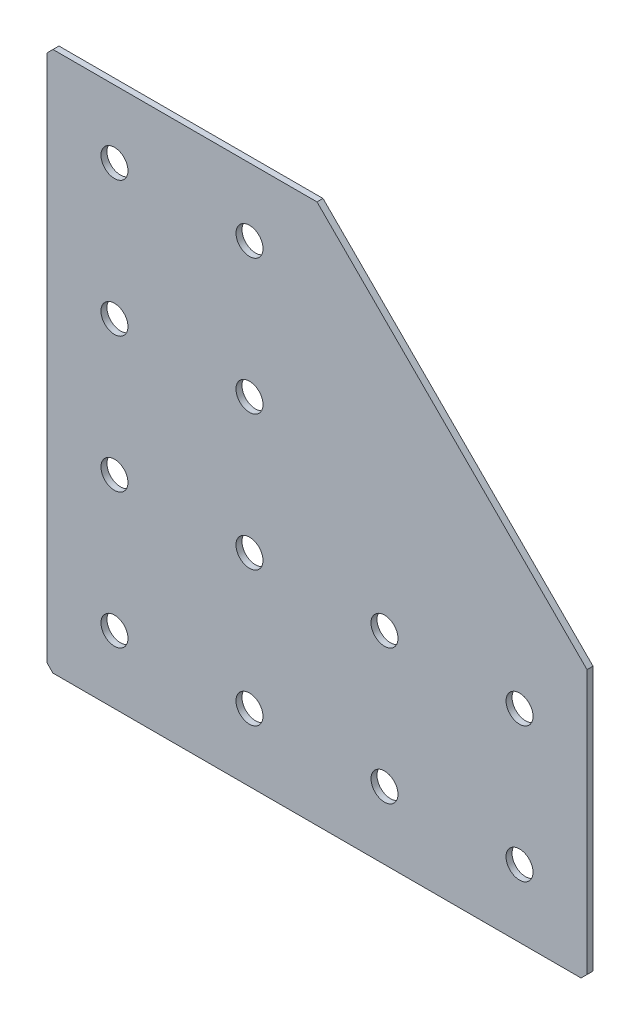
ISO-10303-21;
HEADER;
FILE_DESCRIPTION(('STEP AP214'),'2;1');
FILE_NAME('part.step','',(''),(''),'','','');
FILE_SCHEMA(('AUTOMOTIVE_DESIGN { 1 0 10303 214 1 1 1 1 }'));
ENDSEC;
DATA;
#1=APPLICATION_CONTEXT('core data for automotive mechanical design processes');
#2=APPLICATION_PROTOCOL_DEFINITION('international standard','automotive_design',2000,#1);
#3=PRODUCT_CONTEXT('',#1,'mechanical');
#4=PRODUCT('Part','Part','',(#3));
#5=PRODUCT_RELATED_PRODUCT_CATEGORY('part','',(#4));
#6=PRODUCT_DEFINITION_FORMATION('','',#4);
#7=PRODUCT_DEFINITION_CONTEXT('part definition',#1,'design');
#8=PRODUCT_DEFINITION('design','',#6,#7);
#9=PRODUCT_DEFINITION_SHAPE('','',#8);
#10=(LENGTH_UNIT() NAMED_UNIT(*) SI_UNIT(.MILLI.,.METRE.));
#11=(NAMED_UNIT(*) PLANE_ANGLE_UNIT() SI_UNIT($,.RADIAN.));
#12=(NAMED_UNIT(*) SI_UNIT($,.STERADIAN.) SOLID_ANGLE_UNIT());
#13=UNCERTAINTY_MEASURE_WITH_UNIT(LENGTH_MEASURE(1.E-05),#10,'distance_accuracy_value','');
#14=(GEOMETRIC_REPRESENTATION_CONTEXT(3) GLOBAL_UNCERTAINTY_ASSIGNED_CONTEXT((#13)) GLOBAL_UNIT_ASSIGNED_CONTEXT((#10,
#11,#12)) REPRESENTATION_CONTEXT('',''));
#15=CARTESIAN_POINT('',(0.,0.,0.));
#16=DIRECTION('',(0.,0.,1.));
#17=DIRECTION('',(1.,0.,0.));
#18=AXIS2_PLACEMENT_3D('',#15,#16,#17);
#19=CARTESIAN_POINT('',(90.,0.,-2.));
#20=DIRECTION('',(0.,-1.,0.));
#21=DIRECTION('',(1.,0.,0.));
#22=AXIS2_PLACEMENT_3D('',#19,#20,#21);
#23=PLANE('',#22);
#24=DIRECTION('',(1.,0.,0.));
#25=VECTOR('',#24,1.);
#26=CARTESIAN_POINT('',(90.,0.,-2.));
#27=LINE('',#26,#25);
#28=CARTESIAN_POINT('',(2.,0.,-2.));
#29=VERTEX_POINT('',#28);
#30=CARTESIAN_POINT('',(90.,0.,-2.));
#31=VERTEX_POINT('',#30);
#32=EDGE_CURVE('E106',#29,#31,#27,.T.);
#33=ORIENTED_EDGE('',*,*,#32,.F.);
#34=DIRECTION('',(0.,0.,1.));
#35=VECTOR('',#34,1.);
#36=CARTESIAN_POINT('',(1.99999999999997,0.,-2.));
#37=LINE('',#36,#35);
#38=CARTESIAN_POINT('',(2.,0.,0.));
#39=VERTEX_POINT('',#38);
#40=EDGE_CURVE('E135',#29,#39,#37,.T.);
#41=ORIENTED_EDGE('',*,*,#40,.T.);
#42=DIRECTION('',(1.,0.,0.));
#43=VECTOR('',#42,1.);
#44=CARTESIAN_POINT('',(90.,0.,0.));
#45=LINE('',#44,#43);
#46=CARTESIAN_POINT('',(90.,0.,0.));
#47=VERTEX_POINT('',#46);
#48=EDGE_CURVE('E132',#39,#47,#45,.T.);
#49=ORIENTED_EDGE('',*,*,#48,.T.);
#50=DIRECTION('',(0.,0.,1.));
#51=VECTOR('',#50,1.);
#52=CARTESIAN_POINT('',(90.,0.,-2.));
#53=LINE('',#52,#51);
#54=EDGE_CURVE('E124',#31,#47,#53,.T.);
#55=ORIENTED_EDGE('',*,*,#54,.F.);
#56=EDGE_LOOP('',(#33,#41,#49,#55));
#57=FACE_BOUND('',#56,.T.);
#58=ADVANCED_FACE('F41',(#57),#23,.F.);
#59=CARTESIAN_POINT('',(180.,-90.,-2.));
#60=DIRECTION('',(-0.707106781186547,-0.707106781186548,0.));
#61=DIRECTION('',(0.707106781186548,-0.707106781186547,0.));
#62=AXIS2_PLACEMENT_3D('',#59,#60,#61);
#63=PLANE('',#62);
#64=DIRECTION('',(0.707106781186548,-0.707106781186547,0.));
#65=VECTOR('',#64,1.);
#66=CARTESIAN_POINT('',(180.,-90.,0.));
#67=LINE('',#66,#65);
#68=CARTESIAN_POINT('',(180.,-90.,0.));
#69=VERTEX_POINT('',#68);
#70=EDGE_CURVE('E192',#47,#69,#67,.T.);
#71=ORIENTED_EDGE('',*,*,#70,.T.);
#72=DIRECTION('',(0.,0.,1.));
#73=VECTOR('',#72,1.);
#74=CARTESIAN_POINT('',(180.,-90.,-2.));
#75=LINE('',#74,#73);
#76=CARTESIAN_POINT('',(180.,-90.,-2.));
#77=VERTEX_POINT('',#76);
#78=EDGE_CURVE('E126',#77,#69,#75,.T.);
#79=ORIENTED_EDGE('',*,*,#78,.F.);
#80=DIRECTION('',(0.707106781186548,-0.707106781186547,0.));
#81=VECTOR('',#80,1.);
#82=CARTESIAN_POINT('',(180.,-90.,-2.));
#83=LINE('',#82,#81);
#84=EDGE_CURVE('E110',#31,#77,#83,.T.);
#85=ORIENTED_EDGE('',*,*,#84,.F.);
#86=ORIENTED_EDGE('',*,*,#54,.T.);
#87=EDGE_LOOP('',(#71,#79,#85,#86));
#88=FACE_BOUND('',#87,.T.);
#89=ADVANCED_FACE('F123',(#88),#63,.F.);
#90=CARTESIAN_POINT('',(180.,-180.,-2.));
#91=DIRECTION('',(-1.,0.,0.));
#92=DIRECTION('',(0.,-1.,0.));
#93=AXIS2_PLACEMENT_3D('',#90,#91,#92);
#94=PLANE('',#93);
#95=DIRECTION('',(0.,-1.,0.));
#96=VECTOR('',#95,1.);
#97=CARTESIAN_POINT('',(180.,-180.,0.));
#98=LINE('',#97,#96);
#99=CARTESIAN_POINT('',(180.,-178.,0.));
#100=VERTEX_POINT('',#99);
#101=EDGE_CURVE('E186',#69,#100,#98,.T.);
#102=ORIENTED_EDGE('',*,*,#101,.T.);
#103=DIRECTION('',(0.,0.,-1.));
#104=VECTOR('',#103,1.);
#105=CARTESIAN_POINT('',(180.,-178.,-2.));
#106=LINE('',#105,#104);
#107=CARTESIAN_POINT('',(180.,-178.,-2.));
#108=VERTEX_POINT('',#107);
#109=EDGE_CURVE('E11',#100,#108,#106,.T.);
#110=ORIENTED_EDGE('',*,*,#109,.T.);
#111=DIRECTION('',(0.,-1.,0.));
#112=VECTOR('',#111,1.);
#113=CARTESIAN_POINT('',(180.,-180.,-2.));
#114=LINE('',#113,#112);
#115=EDGE_CURVE('E129',#77,#108,#114,.T.);
#116=ORIENTED_EDGE('',*,*,#115,.F.);
#117=ORIENTED_EDGE('',*,*,#78,.T.);
#118=EDGE_LOOP('',(#102,#110,#116,#117));
#119=FACE_BOUND('',#118,.T.);
#120=ADVANCED_FACE('F345',(#119),#94,.F.);
#121=CARTESIAN_POINT('',(0.,-180.,-2.));
#122=DIRECTION('',(0.,1.,0.));
#123=DIRECTION('',(0.,0.,1.));
#124=AXIS2_PLACEMENT_3D('',#121,#122,#123);
#125=PLANE('',#124);
#126=DIRECTION('',(-1.,0.,0.));
#127=VECTOR('',#126,1.);
#128=CARTESIAN_POINT('',(0.,-180.,-2.));
#129=LINE('',#128,#127);
#130=CARTESIAN_POINT('',(178.,-180.,-2.));
#131=VERTEX_POINT('',#130);
#132=CARTESIAN_POINT('',(2.00000000000008,-180.,-2.));
#133=VERTEX_POINT('',#132);
#134=EDGE_CURVE('E178',#131,#133,#129,.T.);
#135=ORIENTED_EDGE('',*,*,#134,.F.);
#136=DIRECTION('',(0.,0.,1.));
#137=VECTOR('',#136,1.);
#138=CARTESIAN_POINT('',(178.,-180.,-2.));
#139=LINE('',#138,#137);
#140=CARTESIAN_POINT('',(178.,-180.,0.));
#141=VERTEX_POINT('',#140);
#142=EDGE_CURVE('E50',#131,#141,#139,.T.);
#143=ORIENTED_EDGE('',*,*,#142,.T.);
#144=DIRECTION('',(-1.,0.,0.));
#145=VECTOR('',#144,1.);
#146=CARTESIAN_POINT('',(0.,-180.,0.));
#147=LINE('',#146,#145);
#148=CARTESIAN_POINT('',(2.00000000000008,-180.,0.));
#149=VERTEX_POINT('',#148);
#150=EDGE_CURVE('E177',#141,#149,#147,.T.);
#151=ORIENTED_EDGE('',*,*,#150,.T.);
#152=DIRECTION('',(0.,0.,-1.));
#153=VECTOR('',#152,1.);
#154=CARTESIAN_POINT('',(2.00000000000008,-180.,-2.));
#155=LINE('',#154,#153);
#156=EDGE_CURVE('E57',#149,#133,#155,.T.);
#157=ORIENTED_EDGE('',*,*,#156,.T.);
#158=EDGE_LOOP('',(#135,#143,#151,#157));
#159=FACE_BOUND('',#158,.T.);
#160=ADVANCED_FACE('F176',(#159),#125,.F.);
#161=CARTESIAN_POINT('',(0.,0.,-2.));
#162=DIRECTION('',(1.,0.,0.));
#163=DIRECTION('',(0.,0.,-1.));
#164=AXIS2_PLACEMENT_3D('',#161,#162,#163);
#165=PLANE('',#164);
#166=DIRECTION('',(0.,1.,0.));
#167=VECTOR('',#166,1.);
#168=CARTESIAN_POINT('',(0.,0.,0.));
#169=LINE('',#168,#167);
#170=CARTESIAN_POINT('',(0.,-178.,0.));
#171=VERTEX_POINT('',#170);
#172=CARTESIAN_POINT('',(0.,-2.,0.));
#173=VERTEX_POINT('',#172);
#174=EDGE_CURVE('E119',#171,#173,#169,.T.);
#175=ORIENTED_EDGE('',*,*,#174,.T.);
#176=DIRECTION('',(0.,0.,-1.));
#177=VECTOR('',#176,1.);
#178=CARTESIAN_POINT('',(0.,-2.,-2.));
#179=LINE('',#178,#177);
#180=CARTESIAN_POINT('',(0.,-2.,-2.));
#181=VERTEX_POINT('',#180);
#182=EDGE_CURVE('E159',#173,#181,#179,.T.);
#183=ORIENTED_EDGE('',*,*,#182,.T.);
#184=DIRECTION('',(0.,1.,0.));
#185=VECTOR('',#184,1.);
#186=CARTESIAN_POINT('',(0.,0.,-2.));
#187=LINE('',#186,#185);
#188=CARTESIAN_POINT('',(0.,-178.,-2.));
#189=VERTEX_POINT('',#188);
#190=EDGE_CURVE('E143',#189,#181,#187,.T.);
#191=ORIENTED_EDGE('',*,*,#190,.F.);
#192=DIRECTION('',(0.,0.,1.));
#193=VECTOR('',#192,1.);
#194=CARTESIAN_POINT('',(0.,-178.,-2.));
#195=LINE('',#194,#193);
#196=EDGE_CURVE('E155',#189,#171,#195,.T.);
#197=ORIENTED_EDGE('',*,*,#196,.T.);
#198=EDGE_LOOP('',(#175,#183,#191,#197));
#199=FACE_BOUND('',#198,.T.);
#200=ADVANCED_FACE('F301',(#199),#165,.F.);
#201=CARTESIAN_POINT('',(0.,0.,-2.));
#202=DIRECTION('',(0.,0.,1.));
#203=DIRECTION('',(1.,0.,0.));
#204=AXIS2_PLACEMENT_3D('',#201,#202,#203);
#205=PLANE('',#204);
#206=CARTESIAN_POINT('',(22.5,-157.5,-2.00000000000001));
#207=DIRECTION('',(0.,0.,-1.));
#208=DIRECTION('',(0.,1.,0.));
#209=AXIS2_PLACEMENT_3D('',#206,#207,#208);
#210=CIRCLE('',#209,4.5);
#211=CARTESIAN_POINT('',(22.5,-153.,-2.00000000000001));
#212=VERTEX_POINT('',#211);
#213=EDGE_CURVE('E292',#212,#212,#210,.T.);
#214=ORIENTED_EDGE('',*,*,#213,.F.);
#215=EDGE_LOOP('',(#214));
#216=FACE_BOUND('',#215,.T.);
#217=CARTESIAN_POINT('',(22.5,-112.5,-2.00000000000001));
#218=DIRECTION('',(0.,0.,-1.));
#219=DIRECTION('',(0.,1.,0.));
#220=AXIS2_PLACEMENT_3D('',#217,#218,#219);
#221=CIRCLE('',#220,4.5);
#222=CARTESIAN_POINT('',(22.5,-108.,-2.00000000000001));
#223=VERTEX_POINT('',#222);
#224=EDGE_CURVE('E284',#223,#223,#221,.T.);
#225=ORIENTED_EDGE('',*,*,#224,.F.);
#226=EDGE_LOOP('',(#225));
#227=FACE_BOUND('',#226,.T.);
#228=CARTESIAN_POINT('',(22.5,-67.5,-2.));
#229=DIRECTION('',(0.,0.,-1.));
#230=DIRECTION('',(0.,1.,0.));
#231=AXIS2_PLACEMENT_3D('',#228,#229,#230);
#232=CIRCLE('',#231,4.5);
#233=CARTESIAN_POINT('',(22.5,-63.,-2.));
#234=VERTEX_POINT('',#233);
#235=EDGE_CURVE('E276',#234,#234,#232,.T.);
#236=ORIENTED_EDGE('',*,*,#235,.F.);
#237=EDGE_LOOP('',(#236));
#238=FACE_BOUND('',#237,.T.);
#239=CARTESIAN_POINT('',(22.5,-22.5,-2.));
#240=DIRECTION('',(0.,0.,-1.));
#241=DIRECTION('',(0.,1.,0.));
#242=AXIS2_PLACEMENT_3D('',#239,#240,#241);
#243=CIRCLE('',#242,4.5);
#244=CARTESIAN_POINT('',(22.5,-18.,-2.));
#245=VERTEX_POINT('',#244);
#246=EDGE_CURVE('E268',#245,#245,#243,.T.);
#247=ORIENTED_EDGE('',*,*,#246,.F.);
#248=EDGE_LOOP('',(#247));
#249=FACE_BOUND('',#248,.T.);
#250=CARTESIAN_POINT('',(67.5,-157.5,-2.00000000000001));
#251=DIRECTION('',(0.,0.,-1.));
#252=DIRECTION('',(0.,1.,0.));
#253=AXIS2_PLACEMENT_3D('',#250,#251,#252);
#254=CIRCLE('',#253,4.5);
#255=CARTESIAN_POINT('',(67.5,-153.,-2.00000000000001));
#256=VERTEX_POINT('',#255);
#257=EDGE_CURVE('E260',#256,#256,#254,.T.);
#258=ORIENTED_EDGE('',*,*,#257,.F.);
#259=EDGE_LOOP('',(#258));
#260=FACE_BOUND('',#259,.T.);
#261=CARTESIAN_POINT('',(67.5,-112.5,-2.00000000000001));
#262=DIRECTION('',(0.,0.,-1.));
#263=DIRECTION('',(0.,1.,0.));
#264=AXIS2_PLACEMENT_3D('',#261,#262,#263);
#265=CIRCLE('',#264,4.5);
#266=CARTESIAN_POINT('',(67.5,-108.,-2.00000000000001));
#267=VERTEX_POINT('',#266);
#268=EDGE_CURVE('E252',#267,#267,#265,.T.);
#269=ORIENTED_EDGE('',*,*,#268,.F.);
#270=EDGE_LOOP('',(#269));
#271=FACE_BOUND('',#270,.T.);
#272=CARTESIAN_POINT('',(67.5,-67.5,-2.));
#273=DIRECTION('',(0.,0.,-1.));
#274=DIRECTION('',(0.,1.,0.));
#275=AXIS2_PLACEMENT_3D('',#272,#273,#274);
#276=CIRCLE('',#275,4.5);
#277=CARTESIAN_POINT('',(67.5,-63.,-2.));
#278=VERTEX_POINT('',#277);
#279=EDGE_CURVE('E245',#278,#278,#276,.T.);
#280=ORIENTED_EDGE('',*,*,#279,.F.);
#281=EDGE_LOOP('',(#280));
#282=FACE_BOUND('',#281,.T.);
#283=CARTESIAN_POINT('',(67.5,-22.5,-2.));
#284=DIRECTION('',(0.,0.,-1.));
#285=DIRECTION('',(0.,1.,0.));
#286=AXIS2_PLACEMENT_3D('',#283,#284,#285);
#287=CIRCLE('',#286,4.5);
#288=CARTESIAN_POINT('',(67.5,-18.,-2.));
#289=VERTEX_POINT('',#288);
#290=EDGE_CURVE('E237',#289,#289,#287,.T.);
#291=ORIENTED_EDGE('',*,*,#290,.F.);
#292=EDGE_LOOP('',(#291));
#293=FACE_BOUND('',#292,.T.);
#294=CARTESIAN_POINT('',(112.5,-157.5,-2.00000000000001));
#295=DIRECTION('',(0.,0.,-1.));
#296=DIRECTION('',(0.,1.,0.));
#297=AXIS2_PLACEMENT_3D('',#294,#295,#296);
#298=CIRCLE('',#297,4.5);
#299=CARTESIAN_POINT('',(112.5,-153.,-2.00000000000001));
#300=VERTEX_POINT('',#299);
#301=EDGE_CURVE('E229',#300,#300,#298,.T.);
#302=ORIENTED_EDGE('',*,*,#301,.F.);
#303=EDGE_LOOP('',(#302));
#304=FACE_BOUND('',#303,.T.);
#305=CARTESIAN_POINT('',(112.5,-112.5,-2.00000000000001));
#306=DIRECTION('',(0.,0.,-1.));
#307=DIRECTION('',(0.,1.,0.));
#308=AXIS2_PLACEMENT_3D('',#305,#306,#307);
#309=CIRCLE('',#308,4.5);
#310=CARTESIAN_POINT('',(112.5,-108.,-2.00000000000001));
#311=VERTEX_POINT('',#310);
#312=EDGE_CURVE('E223',#311,#311,#309,.T.);
#313=ORIENTED_EDGE('',*,*,#312,.F.);
#314=EDGE_LOOP('',(#313));
#315=FACE_BOUND('',#314,.T.);
#316=CARTESIAN_POINT('',(157.5,-157.5,-2.00000000000001));
#317=DIRECTION('',(0.,0.,-1.));
#318=DIRECTION('',(0.,1.,0.));
#319=AXIS2_PLACEMENT_3D('',#316,#317,#318);
#320=CIRCLE('',#319,4.5);
#321=CARTESIAN_POINT('',(157.5,-153.,-2.00000000000001));
#322=VERTEX_POINT('',#321);
#323=EDGE_CURVE('E215',#322,#322,#320,.T.);
#324=ORIENTED_EDGE('',*,*,#323,.F.);
#325=EDGE_LOOP('',(#324));
#326=FACE_BOUND('',#325,.T.);
#327=CARTESIAN_POINT('',(157.5,-112.5,-2.00000000000001));
#328=DIRECTION('',(0.,0.,-1.));
#329=DIRECTION('',(0.,1.,0.));
#330=AXIS2_PLACEMENT_3D('',#327,#328,#329);
#331=CIRCLE('',#330,4.5);
#332=CARTESIAN_POINT('',(157.5,-108.,-2.00000000000001));
#333=VERTEX_POINT('',#332);
#334=EDGE_CURVE('E208',#333,#333,#331,.T.);
#335=ORIENTED_EDGE('',*,*,#334,.F.);
#336=EDGE_LOOP('',(#335));
#337=FACE_BOUND('',#336,.T.);
#338=ORIENTED_EDGE('',*,*,#190,.T.);
#339=DIRECTION('',(-0.707106781186543,-0.707106781186552,0.));
#340=VECTOR('',#339,1.);
#341=CARTESIAN_POINT('',(1.99999999999997,0.,-2.));
#342=LINE('',#341,#340);
#343=EDGE_CURVE('E113',#181,#29,#342,.F.);
#344=ORIENTED_EDGE('',*,*,#343,.T.);
#345=ORIENTED_EDGE('',*,*,#32,.T.);
#346=ORIENTED_EDGE('',*,*,#84,.T.);
#347=ORIENTED_EDGE('',*,*,#115,.T.);
#348=DIRECTION('',(0.707106781186543,0.707106781186552,0.));
#349=VECTOR('',#348,1.);
#350=CARTESIAN_POINT('',(178.,-180.,-2.));
#351=LINE('',#350,#349);
#352=EDGE_CURVE('E64',#108,#131,#351,.F.);
#353=ORIENTED_EDGE('',*,*,#352,.T.);
#354=ORIENTED_EDGE('',*,*,#134,.T.);
#355=DIRECTION('',(0.707106781186552,-0.707106781186543,0.));
#356=VECTOR('',#355,1.);
#357=CARTESIAN_POINT('',(0.,-178.,-2.));
#358=LINE('',#357,#356);
#359=EDGE_CURVE('E162',#133,#189,#358,.F.);
#360=ORIENTED_EDGE('',*,*,#359,.T.);
#361=EDGE_LOOP('',(#338,#344,#345,#346,#347,#353,#354,#360));
#362=FACE_BOUND('',#361,.T.);
#363=ADVANCED_FACE('F109',(#216,#227,#238,#249,#260,#271,#282,#293,#304,#315,#326,#337,#362),
#205,.F.);
#364=CARTESIAN_POINT('',(0.,0.,0.));
#365=DIRECTION('',(0.,0.,1.));
#366=DIRECTION('',(1.,0.,0.));
#367=AXIS2_PLACEMENT_3D('',#364,#365,#366);
#368=PLANE('',#367);
#369=CARTESIAN_POINT('',(22.5,-157.5,0.));
#370=DIRECTION('',(0.,0.,-1.));
#371=DIRECTION('',(0.,1.,0.));
#372=AXIS2_PLACEMENT_3D('',#369,#370,#371);
#373=CIRCLE('',#372,4.5);
#374=CARTESIAN_POINT('',(22.5,-153.,0.));
#375=VERTEX_POINT('',#374);
#376=EDGE_CURVE('E288',#375,#375,#373,.T.);
#377=ORIENTED_EDGE('',*,*,#376,.T.);
#378=EDGE_LOOP('',(#377));
#379=FACE_BOUND('',#378,.T.);
#380=CARTESIAN_POINT('',(22.5,-112.5,0.));
#381=DIRECTION('',(0.,0.,-1.));
#382=DIRECTION('',(0.,1.,0.));
#383=AXIS2_PLACEMENT_3D('',#380,#381,#382);
#384=CIRCLE('',#383,4.5);
#385=CARTESIAN_POINT('',(22.5,-108.,0.));
#386=VERTEX_POINT('',#385);
#387=EDGE_CURVE('E280',#386,#386,#384,.T.);
#388=ORIENTED_EDGE('',*,*,#387,.T.);
#389=EDGE_LOOP('',(#388));
#390=FACE_BOUND('',#389,.T.);
#391=CARTESIAN_POINT('',(22.5,-67.5,0.));
#392=DIRECTION('',(0.,0.,-1.));
#393=DIRECTION('',(0.,1.,0.));
#394=AXIS2_PLACEMENT_3D('',#391,#392,#393);
#395=CIRCLE('',#394,4.5);
#396=CARTESIAN_POINT('',(22.5,-63.,0.));
#397=VERTEX_POINT('',#396);
#398=EDGE_CURVE('E272',#397,#397,#395,.T.);
#399=ORIENTED_EDGE('',*,*,#398,.T.);
#400=EDGE_LOOP('',(#399));
#401=FACE_BOUND('',#400,.T.);
#402=CARTESIAN_POINT('',(22.5,-22.5,0.));
#403=DIRECTION('',(0.,0.,-1.));
#404=DIRECTION('',(0.,1.,0.));
#405=AXIS2_PLACEMENT_3D('',#402,#403,#404);
#406=CIRCLE('',#405,4.5);
#407=CARTESIAN_POINT('',(22.5,-18.,0.));
#408=VERTEX_POINT('',#407);
#409=EDGE_CURVE('E264',#408,#408,#406,.T.);
#410=ORIENTED_EDGE('',*,*,#409,.T.);
#411=EDGE_LOOP('',(#410));
#412=FACE_BOUND('',#411,.T.);
#413=CARTESIAN_POINT('',(67.5,-157.5,0.));
#414=DIRECTION('',(0.,0.,-1.));
#415=DIRECTION('',(0.,1.,0.));
#416=AXIS2_PLACEMENT_3D('',#413,#414,#415);
#417=CIRCLE('',#416,4.5);
#418=CARTESIAN_POINT('',(67.5,-153.,0.));
#419=VERTEX_POINT('',#418);
#420=EDGE_CURVE('E256',#419,#419,#417,.T.);
#421=ORIENTED_EDGE('',*,*,#420,.T.);
#422=EDGE_LOOP('',(#421));
#423=FACE_BOUND('',#422,.T.);
#424=CARTESIAN_POINT('',(67.5,-112.5,0.));
#425=DIRECTION('',(0.,0.,-1.));
#426=DIRECTION('',(0.,1.,0.));
#427=AXIS2_PLACEMENT_3D('',#424,#425,#426);
#428=CIRCLE('',#427,4.5);
#429=CARTESIAN_POINT('',(67.5,-108.,0.));
#430=VERTEX_POINT('',#429);
#431=EDGE_CURVE('E249',#430,#430,#428,.T.);
#432=ORIENTED_EDGE('',*,*,#431,.T.);
#433=EDGE_LOOP('',(#432));
#434=FACE_BOUND('',#433,.T.);
#435=CARTESIAN_POINT('',(67.5,-67.5,0.));
#436=DIRECTION('',(0.,0.,-1.));
#437=DIRECTION('',(0.,1.,0.));
#438=AXIS2_PLACEMENT_3D('',#435,#436,#437);
#439=CIRCLE('',#438,4.5);
#440=CARTESIAN_POINT('',(67.5,-63.,0.));
#441=VERTEX_POINT('',#440);
#442=EDGE_CURVE('E241',#441,#441,#439,.T.);
#443=ORIENTED_EDGE('',*,*,#442,.T.);
#444=EDGE_LOOP('',(#443));
#445=FACE_BOUND('',#444,.T.);
#446=CARTESIAN_POINT('',(67.5,-22.5,0.));
#447=DIRECTION('',(0.,0.,-1.));
#448=DIRECTION('',(0.,1.,0.));
#449=AXIS2_PLACEMENT_3D('',#446,#447,#448);
#450=CIRCLE('',#449,4.5);
#451=CARTESIAN_POINT('',(67.5,-18.,0.));
#452=VERTEX_POINT('',#451);
#453=EDGE_CURVE('E233',#452,#452,#450,.T.);
#454=ORIENTED_EDGE('',*,*,#453,.T.);
#455=EDGE_LOOP('',(#454));
#456=FACE_BOUND('',#455,.T.);
#457=CARTESIAN_POINT('',(112.5,-157.5,0.));
#458=DIRECTION('',(0.,0.,-1.));
#459=DIRECTION('',(0.,1.,0.));
#460=AXIS2_PLACEMENT_3D('',#457,#458,#459);
#461=CIRCLE('',#460,4.5);
#462=CARTESIAN_POINT('',(112.5,-153.,0.));
#463=VERTEX_POINT('',#462);
#464=EDGE_CURVE('E226',#463,#463,#461,.T.);
#465=ORIENTED_EDGE('',*,*,#464,.T.);
#466=EDGE_LOOP('',(#465));
#467=FACE_BOUND('',#466,.T.);
#468=CARTESIAN_POINT('',(112.5,-112.5,0.));
#469=DIRECTION('',(0.,0.,-1.));
#470=DIRECTION('',(0.,1.,0.));
#471=AXIS2_PLACEMENT_3D('',#468,#469,#470);
#472=CIRCLE('',#471,4.5);
#473=CARTESIAN_POINT('',(112.5,-108.,0.));
#474=VERTEX_POINT('',#473);
#475=EDGE_CURVE('E219',#474,#474,#472,.T.);
#476=ORIENTED_EDGE('',*,*,#475,.T.);
#477=EDGE_LOOP('',(#476));
#478=FACE_BOUND('',#477,.T.);
#479=CARTESIAN_POINT('',(157.5,-157.5,0.));
#480=DIRECTION('',(0.,0.,-1.));
#481=DIRECTION('',(0.,1.,0.));
#482=AXIS2_PLACEMENT_3D('',#479,#480,#481);
#483=CIRCLE('',#482,4.5);
#484=CARTESIAN_POINT('',(157.5,-153.,0.));
#485=VERTEX_POINT('',#484);
#486=EDGE_CURVE('E212',#485,#485,#483,.T.);
#487=ORIENTED_EDGE('',*,*,#486,.T.);
#488=EDGE_LOOP('',(#487));
#489=FACE_BOUND('',#488,.T.);
#490=CARTESIAN_POINT('',(157.5,-112.5,0.));
#491=DIRECTION('',(0.,0.,-1.));
#492=DIRECTION('',(0.,1.,0.));
#493=AXIS2_PLACEMENT_3D('',#490,#491,#492);
#494=CIRCLE('',#493,4.5);
#495=CARTESIAN_POINT('',(157.5,-108.,0.));
#496=VERTEX_POINT('',#495);
#497=EDGE_CURVE('E199',#496,#496,#494,.T.);
#498=ORIENTED_EDGE('',*,*,#497,.T.);
#499=EDGE_LOOP('',(#498));
#500=FACE_BOUND('',#499,.T.);
#501=ORIENTED_EDGE('',*,*,#48,.F.);
#502=DIRECTION('',(0.707106781186543,0.707106781186552,0.));
#503=VECTOR('',#502,1.);
#504=CARTESIAN_POINT('',(1.,-0.999999999999987,0.));
#505=LINE('',#504,#503);
#506=EDGE_CURVE('E152',#39,#173,#505,.F.);
#507=ORIENTED_EDGE('',*,*,#506,.T.);
#508=ORIENTED_EDGE('',*,*,#174,.F.);
#509=DIRECTION('',(-0.707106781186552,0.707106781186543,0.));
#510=VECTOR('',#509,1.);
#511=CARTESIAN_POINT('',(-89.,-89.0000000000012,0.));
#512=LINE('',#511,#510);
#513=EDGE_CURVE('E140',#171,#149,#512,.F.);
#514=ORIENTED_EDGE('',*,*,#513,.T.);
#515=ORIENTED_EDGE('',*,*,#150,.F.);
#516=DIRECTION('',(-0.707106781186543,-0.707106781186552,0.));
#517=VECTOR('',#516,1.);
#518=CARTESIAN_POINT('',(179.000000000001,-178.999999999999,0.));
#519=LINE('',#518,#517);
#520=EDGE_CURVE('E149',#141,#100,#519,.F.);
#521=ORIENTED_EDGE('',*,*,#520,.T.);
#522=ORIENTED_EDGE('',*,*,#101,.F.);
#523=ORIENTED_EDGE('',*,*,#70,.F.);
#524=EDGE_LOOP('',(#501,#507,#508,#514,#515,#521,#522,#523));
#525=FACE_BOUND('',#524,.T.);
#526=ADVANCED_FACE('F181',(#379,#390,#401,#412,#423,#434,#445,#456,#467,#478,#489,#500,#525),
#368,.T.);
#527=CARTESIAN_POINT('',(157.5,-112.5,-2.00000000000001));
#528=DIRECTION('',(0.,0.,-1.));
#529=DIRECTION('',(0.,1.,0.));
#530=AXIS2_PLACEMENT_3D('',#527,#528,#529);
#531=CYLINDRICAL_SURFACE('',#530,4.5);
#532=ORIENTED_EDGE('',*,*,#497,.F.);
#533=EDGE_LOOP('',(#532));
#534=FACE_BOUND('',#533,.T.);
#535=ORIENTED_EDGE('',*,*,#334,.T.);
#536=EDGE_LOOP('',(#535));
#537=FACE_BOUND('',#536,.T.);
#538=ADVANCED_FACE('F325',(#534,#537),#531,.F.);
#539=CARTESIAN_POINT('',(157.5,-157.5,-2.00000000000001));
#540=DIRECTION('',(0.,0.,-1.));
#541=DIRECTION('',(0.,1.,0.));
#542=AXIS2_PLACEMENT_3D('',#539,#540,#541);
#543=CYLINDRICAL_SURFACE('',#542,4.5);
#544=ORIENTED_EDGE('',*,*,#486,.F.);
#545=EDGE_LOOP('',(#544));
#546=FACE_BOUND('',#545,.T.);
#547=ORIENTED_EDGE('',*,*,#323,.T.);
#548=EDGE_LOOP('',(#547));
#549=FACE_BOUND('',#548,.T.);
#550=ADVANCED_FACE('F327',(#546,#549),#543,.F.);
#551=CARTESIAN_POINT('',(112.5,-112.5,-2.00000000000001));
#552=DIRECTION('',(0.,0.,-1.));
#553=DIRECTION('',(0.,1.,0.));
#554=AXIS2_PLACEMENT_3D('',#551,#552,#553);
#555=CYLINDRICAL_SURFACE('',#554,4.5);
#556=ORIENTED_EDGE('',*,*,#475,.F.);
#557=EDGE_LOOP('',(#556));
#558=FACE_BOUND('',#557,.T.);
#559=ORIENTED_EDGE('',*,*,#312,.T.);
#560=EDGE_LOOP('',(#559));
#561=FACE_BOUND('',#560,.T.);
#562=ADVANCED_FACE('F334',(#558,#561),#555,.F.);
#563=CARTESIAN_POINT('',(112.5,-157.5,-2.00000000000001));
#564=DIRECTION('',(0.,0.,-1.));
#565=DIRECTION('',(0.,1.,0.));
#566=AXIS2_PLACEMENT_3D('',#563,#564,#565);
#567=CYLINDRICAL_SURFACE('',#566,4.5);
#568=ORIENTED_EDGE('',*,*,#464,.F.);
#569=EDGE_LOOP('',(#568));
#570=FACE_BOUND('',#569,.T.);
#571=ORIENTED_EDGE('',*,*,#301,.T.);
#572=EDGE_LOOP('',(#571));
#573=FACE_BOUND('',#572,.T.);
#574=ADVANCED_FACE('F409',(#570,#573),#567,.F.);
#575=CARTESIAN_POINT('',(67.5,-22.5,-2.));
#576=DIRECTION('',(0.,0.,-1.));
#577=DIRECTION('',(0.,1.,0.));
#578=AXIS2_PLACEMENT_3D('',#575,#576,#577);
#579=CYLINDRICAL_SURFACE('',#578,4.5);
#580=ORIENTED_EDGE('',*,*,#453,.F.);
#581=EDGE_LOOP('',(#580));
#582=FACE_BOUND('',#581,.T.);
#583=ORIENTED_EDGE('',*,*,#290,.T.);
#584=EDGE_LOOP('',(#583));
#585=FACE_BOUND('',#584,.T.);
#586=ADVANCED_FACE('F418',(#582,#585),#579,.F.);
#587=CARTESIAN_POINT('',(67.5,-67.5,-2.));
#588=DIRECTION('',(0.,0.,-1.));
#589=DIRECTION('',(0.,1.,0.));
#590=AXIS2_PLACEMENT_3D('',#587,#588,#589);
#591=CYLINDRICAL_SURFACE('',#590,4.5);
#592=ORIENTED_EDGE('',*,*,#442,.F.);
#593=EDGE_LOOP('',(#592));
#594=FACE_BOUND('',#593,.T.);
#595=ORIENTED_EDGE('',*,*,#279,.T.);
#596=EDGE_LOOP('',(#595));
#597=FACE_BOUND('',#596,.T.);
#598=ADVANCED_FACE('F427',(#594,#597),#591,.F.);
#599=CARTESIAN_POINT('',(67.5,-112.5,-2.00000000000001));
#600=DIRECTION('',(0.,0.,-1.));
#601=DIRECTION('',(0.,1.,0.));
#602=AXIS2_PLACEMENT_3D('',#599,#600,#601);
#603=CYLINDRICAL_SURFACE('',#602,4.5);
#604=ORIENTED_EDGE('',*,*,#431,.F.);
#605=EDGE_LOOP('',(#604));
#606=FACE_BOUND('',#605,.T.);
#607=ORIENTED_EDGE('',*,*,#268,.T.);
#608=EDGE_LOOP('',(#607));
#609=FACE_BOUND('',#608,.T.);
#610=ADVANCED_FACE('F436',(#606,#609),#603,.F.);
#611=CARTESIAN_POINT('',(67.5,-157.5,-2.00000000000001));
#612=DIRECTION('',(0.,0.,-1.));
#613=DIRECTION('',(0.,1.,0.));
#614=AXIS2_PLACEMENT_3D('',#611,#612,#613);
#615=CYLINDRICAL_SURFACE('',#614,4.5);
#616=ORIENTED_EDGE('',*,*,#420,.F.);
#617=EDGE_LOOP('',(#616));
#618=FACE_BOUND('',#617,.T.);
#619=ORIENTED_EDGE('',*,*,#257,.T.);
#620=EDGE_LOOP('',(#619));
#621=FACE_BOUND('',#620,.T.);
#622=ADVANCED_FACE('F445',(#618,#621),#615,.F.);
#623=CARTESIAN_POINT('',(22.5,-22.5,-2.));
#624=DIRECTION('',(0.,0.,-1.));
#625=DIRECTION('',(0.,1.,0.));
#626=AXIS2_PLACEMENT_3D('',#623,#624,#625);
#627=CYLINDRICAL_SURFACE('',#626,4.5);
#628=ORIENTED_EDGE('',*,*,#409,.F.);
#629=EDGE_LOOP('',(#628));
#630=FACE_BOUND('',#629,.T.);
#631=ORIENTED_EDGE('',*,*,#246,.T.);
#632=EDGE_LOOP('',(#631));
#633=FACE_BOUND('',#632,.T.);
#634=ADVANCED_FACE('F454',(#630,#633),#627,.F.);
#635=CARTESIAN_POINT('',(22.5,-67.5,-2.));
#636=DIRECTION('',(0.,0.,-1.));
#637=DIRECTION('',(0.,1.,0.));
#638=AXIS2_PLACEMENT_3D('',#635,#636,#637);
#639=CYLINDRICAL_SURFACE('',#638,4.5);
#640=ORIENTED_EDGE('',*,*,#398,.F.);
#641=EDGE_LOOP('',(#640));
#642=FACE_BOUND('',#641,.T.);
#643=ORIENTED_EDGE('',*,*,#235,.T.);
#644=EDGE_LOOP('',(#643));
#645=FACE_BOUND('',#644,.T.);
#646=ADVANCED_FACE('F463',(#642,#645),#639,.F.);
#647=CARTESIAN_POINT('',(22.5,-112.5,-2.00000000000001));
#648=DIRECTION('',(0.,0.,-1.));
#649=DIRECTION('',(0.,1.,0.));
#650=AXIS2_PLACEMENT_3D('',#647,#648,#649);
#651=CYLINDRICAL_SURFACE('',#650,4.5);
#652=ORIENTED_EDGE('',*,*,#387,.F.);
#653=EDGE_LOOP('',(#652));
#654=FACE_BOUND('',#653,.T.);
#655=ORIENTED_EDGE('',*,*,#224,.T.);
#656=EDGE_LOOP('',(#655));
#657=FACE_BOUND('',#656,.T.);
#658=ADVANCED_FACE('F472',(#654,#657),#651,.F.);
#659=CARTESIAN_POINT('',(22.5,-157.5,-2.00000000000001));
#660=DIRECTION('',(0.,0.,-1.));
#661=DIRECTION('',(0.,1.,0.));
#662=AXIS2_PLACEMENT_3D('',#659,#660,#661);
#663=CYLINDRICAL_SURFACE('',#662,4.5);
#664=ORIENTED_EDGE('',*,*,#376,.F.);
#665=EDGE_LOOP('',(#664));
#666=FACE_BOUND('',#665,.T.);
#667=ORIENTED_EDGE('',*,*,#213,.T.);
#668=EDGE_LOOP('',(#667));
#669=FACE_BOUND('',#668,.T.);
#670=ADVANCED_FACE('F297',(#666,#669),#663,.F.);
#671=CARTESIAN_POINT('',(1.99999999999997,0.,-2.));
#672=DIRECTION('',(0.707106781186552,-0.707106781186543,0.));
#673=DIRECTION('',(0.,0.,1.));
#674=AXIS2_PLACEMENT_3D('',#671,#672,#673);
#675=PLANE('',#674);
#676=ORIENTED_EDGE('',*,*,#343,.F.);
#677=ORIENTED_EDGE('',*,*,#182,.F.);
#678=ORIENTED_EDGE('',*,*,#506,.F.);
#679=ORIENTED_EDGE('',*,*,#40,.F.);
#680=EDGE_LOOP('',(#676,#677,#678,#679));
#681=FACE_BOUND('',#680,.T.);
#682=ADVANCED_FACE('F349',(#681),#675,.F.);
#683=CARTESIAN_POINT('',(178.,-180.,-2.));
#684=DIRECTION('',(-0.707106781186552,0.707106781186543,0.));
#685=DIRECTION('',(0.,0.,1.));
#686=AXIS2_PLACEMENT_3D('',#683,#684,#685);
#687=PLANE('',#686);
#688=ORIENTED_EDGE('',*,*,#352,.F.);
#689=ORIENTED_EDGE('',*,*,#109,.F.);
#690=ORIENTED_EDGE('',*,*,#520,.F.);
#691=ORIENTED_EDGE('',*,*,#142,.F.);
#692=EDGE_LOOP('',(#688,#689,#690,#691));
#693=FACE_BOUND('',#692,.T.);
#694=ADVANCED_FACE('F351',(#693),#687,.F.);
#695=CARTESIAN_POINT('',(0.,-178.,-2.));
#696=DIRECTION('',(0.707106781186543,0.707106781186552,0.));
#697=DIRECTION('',(0.,0.,1.));
#698=AXIS2_PLACEMENT_3D('',#695,#696,#697);
#699=PLANE('',#698);
#700=ORIENTED_EDGE('',*,*,#359,.F.);
#701=ORIENTED_EDGE('',*,*,#156,.F.);
#702=ORIENTED_EDGE('',*,*,#513,.F.);
#703=ORIENTED_EDGE('',*,*,#196,.F.);
#704=EDGE_LOOP('',(#700,#701,#702,#703));
#705=FACE_BOUND('',#704,.T.);
#706=ADVANCED_FACE('F43',(#705),#699,.F.);
#707=CLOSED_SHELL('',(#58,#89,#120,#160,#200,#363,#526,#538,#550,#562,#574,#586,#598,#610,#622,
#634,#646,#658,#670,#682,#694,#706));
#708=MANIFOLD_SOLID_BREP('B2',#707);
#709=ADVANCED_BREP_SHAPE_REPRESENTATION('',(#18,#708),#14);
#710=SHAPE_DEFINITION_REPRESENTATION(#9,#709);
ENDSEC;
END-ISO-10303-21;
